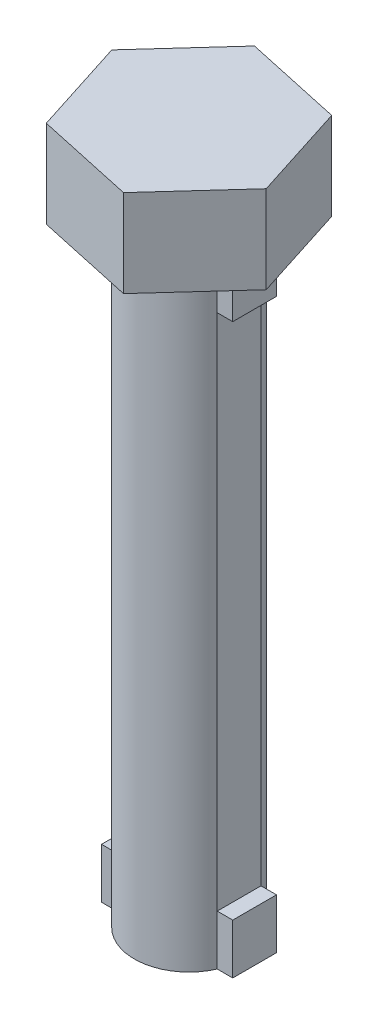
ISO-10303-21;
HEADER;
FILE_DESCRIPTION(('STEP AP214'),'2;1');
FILE_NAME('part.step','',(''),(''),'','','');
FILE_SCHEMA(('AUTOMOTIVE_DESIGN { 1 0 10303 214 1 1 1 1 }'));
ENDSEC;
DATA;
#1=APPLICATION_CONTEXT('core data for automotive mechanical design processes');
#2=APPLICATION_PROTOCOL_DEFINITION('international standard','automotive_design',2000,#1);
#3=PRODUCT_CONTEXT('',#1,'mechanical');
#4=PRODUCT('Part','Part','',(#3));
#5=PRODUCT_RELATED_PRODUCT_CATEGORY('part','',(#4));
#6=PRODUCT_DEFINITION_FORMATION('','',#4);
#7=PRODUCT_DEFINITION_CONTEXT('part definition',#1,'design');
#8=PRODUCT_DEFINITION('design','',#6,#7);
#9=PRODUCT_DEFINITION_SHAPE('','',#8);
#10=(LENGTH_UNIT() NAMED_UNIT(*) SI_UNIT(.MILLI.,.METRE.));
#11=(NAMED_UNIT(*) PLANE_ANGLE_UNIT() SI_UNIT($,.RADIAN.));
#12=(NAMED_UNIT(*) SI_UNIT($,.STERADIAN.) SOLID_ANGLE_UNIT());
#13=UNCERTAINTY_MEASURE_WITH_UNIT(LENGTH_MEASURE(1.E-05),#10,'distance_accuracy_value','');
#14=(GEOMETRIC_REPRESENTATION_CONTEXT(3) GLOBAL_UNCERTAINTY_ASSIGNED_CONTEXT((#13)) GLOBAL_UNIT_ASSIGNED_CONTEXT((#10,
#11,#12)) REPRESENTATION_CONTEXT('',''));
#15=CARTESIAN_POINT('',(0.,0.,0.));
#16=DIRECTION('',(0.,0.,1.));
#17=DIRECTION('',(1.,0.,0.));
#18=AXIS2_PLACEMENT_3D('',#15,#16,#17);
#19=CARTESIAN_POINT('',(-1.14564392373896,14.,0.5));
#20=DIRECTION('',(0.,0.,-1.));
#21=DIRECTION('',(-1.,0.,0.));
#22=AXIS2_PLACEMENT_3D('',#19,#20,#21);
#23=PLANE('',#22);
#24=DIRECTION('',(0.,-1.,0.));
#25=VECTOR('',#24,1.);
#26=CARTESIAN_POINT('',(-1.5,14.,0.5));
#27=LINE('',#26,#25);
#28=CARTESIAN_POINT('',(-1.5,14.,0.5));
#29=VERTEX_POINT('',#28);
#30=CARTESIAN_POINT('',(-1.5,12.9938938876232,0.5));
#31=VERTEX_POINT('',#30);
#32=EDGE_CURVE('E363',#29,#31,#27,.T.);
#33=ORIENTED_EDGE('',*,*,#32,.T.);
#34=DIRECTION('',(1.,0.,0.));
#35=VECTOR('',#34,1.);
#36=CARTESIAN_POINT('',(-1.14564392373896,12.9938938876232,0.5));
#37=LINE('',#36,#35);
#38=CARTESIAN_POINT('',(-1.14564392373896,12.9938938876232,0.5));
#39=VERTEX_POINT('',#38);
#40=EDGE_CURVE('E256',#31,#39,#37,.T.);
#41=ORIENTED_EDGE('',*,*,#40,.T.);
#42=DIRECTION('',(0.,-1.,0.));
#43=VECTOR('',#42,1.);
#44=CARTESIAN_POINT('',(-1.14564392373896,14.,0.5));
#45=LINE('',#44,#43);
#46=CARTESIAN_POINT('',(-1.14564392373896,14.,0.5));
#47=VERTEX_POINT('',#46);
#48=EDGE_CURVE('E244',#47,#39,#45,.T.);
#49=ORIENTED_EDGE('',*,*,#48,.F.);
#50=DIRECTION('',(1.,0.,0.));
#51=VECTOR('',#50,1.);
#52=CARTESIAN_POINT('',(-1.14564392373896,14.,0.5));
#53=LINE('',#52,#51);
#54=EDGE_CURVE('E323',#29,#47,#53,.T.);
#55=ORIENTED_EDGE('',*,*,#54,.F.);
#56=EDGE_LOOP('',(#33,#41,#49,#55));
#57=FACE_BOUND('',#56,.T.);
#58=ADVANCED_FACE('F33',(#57),#23,.F.);
#59=CARTESIAN_POINT('',(1.5,14.,0.5));
#60=DIRECTION('',(0.,0.,-1.));
#61=DIRECTION('',(-1.,0.,0.));
#62=AXIS2_PLACEMENT_3D('',#59,#60,#61);
#63=PLANE('',#62);
#64=DIRECTION('',(0.,-1.,0.));
#65=VECTOR('',#64,1.);
#66=CARTESIAN_POINT('',(1.5,14.,0.5));
#67=LINE('',#66,#65);
#68=CARTESIAN_POINT('',(1.5,1.14700488640253,0.5));
#69=VERTEX_POINT('',#68);
#70=CARTESIAN_POINT('',(1.5,0.,0.5));
#71=VERTEX_POINT('',#70);
#72=EDGE_CURVE('E234',#69,#71,#67,.T.);
#73=ORIENTED_EDGE('',*,*,#72,.F.);
#74=DIRECTION('',(-1.,0.,0.));
#75=VECTOR('',#74,1.);
#76=CARTESIAN_POINT('',(1.5,1.14700488640253,0.5));
#77=LINE('',#76,#75);
#78=CARTESIAN_POINT('',(1.14564392373896,1.14700488640253,0.5));
#79=VERTEX_POINT('',#78);
#80=EDGE_CURVE('E275',#69,#79,#77,.T.);
#81=ORIENTED_EDGE('',*,*,#80,.T.);
#82=DIRECTION('',(0.,-1.,0.));
#83=VECTOR('',#82,1.);
#84=CARTESIAN_POINT('',(1.14564392373896,14.,0.5));
#85=LINE('',#84,#83);
#86=CARTESIAN_POINT('',(1.14564392373896,0.,0.5));
#87=VERTEX_POINT('',#86);
#88=EDGE_CURVE('E239',#79,#87,#85,.T.);
#89=ORIENTED_EDGE('',*,*,#88,.T.);
#90=DIRECTION('',(1.,0.,0.));
#91=VECTOR('',#90,1.);
#92=CARTESIAN_POINT('',(1.5,0.,0.5));
#93=LINE('',#92,#91);
#94=EDGE_CURVE('E352',#87,#71,#93,.T.);
#95=ORIENTED_EDGE('',*,*,#94,.T.);
#96=EDGE_LOOP('',(#73,#81,#89,#95));
#97=FACE_BOUND('',#96,.T.);
#98=ADVANCED_FACE('F390',(#97),#63,.F.);
#99=CARTESIAN_POINT('',(1.5,14.,-0.5));
#100=DIRECTION('',(-1.,0.,0.));
#101=DIRECTION('',(0.,0.,1.));
#102=AXIS2_PLACEMENT_3D('',#99,#100,#101);
#103=PLANE('',#102);
#104=DIRECTION('',(0.,-1.,0.));
#105=VECTOR('',#104,1.);
#106=CARTESIAN_POINT('',(1.5,14.,-0.5));
#107=LINE('',#106,#105);
#108=CARTESIAN_POINT('',(1.5,1.14700488640253,-0.5));
#109=VERTEX_POINT('',#108);
#110=CARTESIAN_POINT('',(1.5,0.,-0.5));
#111=VERTEX_POINT('',#110);
#112=EDGE_CURVE('E226',#109,#111,#107,.T.);
#113=ORIENTED_EDGE('',*,*,#112,.F.);
#114=DIRECTION('',(0.,0.,1.));
#115=VECTOR('',#114,1.);
#116=CARTESIAN_POINT('',(1.5,1.14700488640253,-2.19987668156487));
#117=LINE('',#116,#115);
#118=EDGE_CURVE('E383',#109,#69,#117,.T.);
#119=ORIENTED_EDGE('',*,*,#118,.T.);
#120=ORIENTED_EDGE('',*,*,#72,.T.);
#121=DIRECTION('',(0.,0.,-1.));
#122=VECTOR('',#121,1.);
#123=CARTESIAN_POINT('',(1.5,0.,-0.5));
#124=LINE('',#123,#122);
#125=EDGE_CURVE('E355',#71,#111,#124,.T.);
#126=ORIENTED_EDGE('',*,*,#125,.T.);
#127=EDGE_LOOP('',(#113,#119,#120,#126));
#128=FACE_BOUND('',#127,.T.);
#129=ADVANCED_FACE('F387',(#128),#103,.F.);
#130=CARTESIAN_POINT('',(1.5,14.,-0.5));
#131=DIRECTION('',(0.,0.,1.));
#132=DIRECTION('',(1.,0.,0.));
#133=AXIS2_PLACEMENT_3D('',#130,#131,#132);
#134=PLANE('',#133);
#135=DIRECTION('',(0.,-1.,0.));
#136=VECTOR('',#135,1.);
#137=CARTESIAN_POINT('',(1.14564392373896,14.,-0.5));
#138=LINE('',#137,#136);
#139=CARTESIAN_POINT('',(1.14564392373896,1.14700488640253,-0.5));
#140=VERTEX_POINT('',#139);
#141=CARTESIAN_POINT('',(1.14564392373896,0.,-0.5));
#142=VERTEX_POINT('',#141);
#143=EDGE_CURVE('E215',#140,#142,#138,.T.);
#144=ORIENTED_EDGE('',*,*,#143,.F.);
#145=DIRECTION('',(1.,0.,0.));
#146=VECTOR('',#145,1.);
#147=CARTESIAN_POINT('',(1.5,1.14700488640253,-0.5));
#148=LINE('',#147,#146);
#149=EDGE_CURVE('E273',#140,#109,#148,.T.);
#150=ORIENTED_EDGE('',*,*,#149,.T.);
#151=ORIENTED_EDGE('',*,*,#112,.T.);
#152=DIRECTION('',(-1.,0.,0.));
#153=VECTOR('',#152,1.);
#154=CARTESIAN_POINT('',(1.5,0.,-0.5));
#155=LINE('',#154,#153);
#156=EDGE_CURVE('E357',#111,#142,#155,.T.);
#157=ORIENTED_EDGE('',*,*,#156,.T.);
#158=EDGE_LOOP('',(#144,#150,#151,#157));
#159=FACE_BOUND('',#158,.T.);
#160=ADVANCED_FACE('F399',(#159),#134,.F.);
#161=CARTESIAN_POINT('',(-1.14564392373896,14.,-0.5));
#162=DIRECTION('',(0.,0.,1.));
#163=DIRECTION('',(1.,0.,0.));
#164=AXIS2_PLACEMENT_3D('',#161,#162,#163);
#165=PLANE('',#164);
#166=DIRECTION('',(0.,-1.,0.));
#167=VECTOR('',#166,1.);
#168=CARTESIAN_POINT('',(-1.14564392373896,14.,-0.5));
#169=LINE('',#168,#167);
#170=CARTESIAN_POINT('',(-1.14564392373896,14.,-0.5));
#171=VERTEX_POINT('',#170);
#172=CARTESIAN_POINT('',(-1.14564392373896,12.9938938876232,-0.5));
#173=VERTEX_POINT('',#172);
#174=EDGE_CURVE('E193',#171,#173,#169,.T.);
#175=ORIENTED_EDGE('',*,*,#174,.T.);
#176=DIRECTION('',(-1.,0.,0.));
#177=VECTOR('',#176,1.);
#178=CARTESIAN_POINT('',(-1.14564392373896,12.9938938876232,-0.5));
#179=LINE('',#178,#177);
#180=CARTESIAN_POINT('',(-1.5,12.9938938876232,-0.5));
#181=VERTEX_POINT('',#180);
#182=EDGE_CURVE('E254',#173,#181,#179,.T.);
#183=ORIENTED_EDGE('',*,*,#182,.T.);
#184=DIRECTION('',(0.,-1.,0.));
#185=VECTOR('',#184,1.);
#186=CARTESIAN_POINT('',(-1.5,14.,-0.5));
#187=LINE('',#186,#185);
#188=CARTESIAN_POINT('',(-1.5,14.,-0.5));
#189=VERTEX_POINT('',#188);
#190=EDGE_CURVE('E211',#189,#181,#187,.T.);
#191=ORIENTED_EDGE('',*,*,#190,.F.);
#192=DIRECTION('',(-1.,0.,0.));
#193=VECTOR('',#192,1.);
#194=CARTESIAN_POINT('',(-1.14564392373896,14.,-0.5));
#195=LINE('',#194,#193);
#196=EDGE_CURVE('E342',#171,#189,#195,.T.);
#197=ORIENTED_EDGE('',*,*,#196,.F.);
#198=EDGE_LOOP('',(#175,#183,#191,#197));
#199=FACE_BOUND('',#198,.T.);
#200=ADVANCED_FACE('F373',(#199),#165,.F.);
#201=CARTESIAN_POINT('',(-1.5,14.,-0.5));
#202=DIRECTION('',(1.,0.,0.));
#203=DIRECTION('',(0.,0.,-1.));
#204=AXIS2_PLACEMENT_3D('',#201,#202,#203);
#205=PLANE('',#204);
#206=ORIENTED_EDGE('',*,*,#190,.T.);
#207=DIRECTION('',(0.,0.,1.));
#208=VECTOR('',#207,1.);
#209=CARTESIAN_POINT('',(-1.5,12.9938938876232,-0.5));
#210=LINE('',#209,#208);
#211=EDGE_CURVE('E11',#181,#31,#210,.T.);
#212=ORIENTED_EDGE('',*,*,#211,.T.);
#213=ORIENTED_EDGE('',*,*,#32,.F.);
#214=DIRECTION('',(0.,0.,1.));
#215=VECTOR('',#214,1.);
#216=CARTESIAN_POINT('',(-1.5,14.,-0.5));
#217=LINE('',#216,#215);
#218=EDGE_CURVE('E345',#189,#29,#217,.T.);
#219=ORIENTED_EDGE('',*,*,#218,.F.);
#220=EDGE_LOOP('',(#206,#212,#213,#219));
#221=FACE_BOUND('',#220,.T.);
#222=ADVANCED_FACE('F370',(#221),#205,.F.);
#223=CARTESIAN_POINT('',(-1.14564392373896,1.14700488640253,0.5));
#224=VERTEX_POINT('',#223);
#225=CARTESIAN_POINT('',(-1.14564392373896,0.,0.5));
#226=VERTEX_POINT('',#225);
#227=EDGE_CURVE('E243',#224,#226,#45,.T.);
#228=ORIENTED_EDGE('',*,*,#227,.F.);
#229=DIRECTION('',(-1.,0.,0.));
#230=VECTOR('',#229,1.);
#231=CARTESIAN_POINT('',(-1.14564392373896,1.14700488640253,0.5));
#232=LINE('',#231,#230);
#233=CARTESIAN_POINT('',(-1.5,1.14700488640253,0.5));
#234=VERTEX_POINT('',#233);
#235=EDGE_CURVE('E198',#224,#234,#232,.T.);
#236=ORIENTED_EDGE('',*,*,#235,.T.);
#237=CARTESIAN_POINT('',(-1.5,0.,0.5));
#238=VERTEX_POINT('',#237);
#239=EDGE_CURVE('E250',#234,#238,#27,.T.);
#240=ORIENTED_EDGE('',*,*,#239,.T.);
#241=DIRECTION('',(1.,0.,0.));
#242=VECTOR('',#241,1.);
#243=CARTESIAN_POINT('',(-1.14564392373896,0.,0.5));
#244=LINE('',#243,#242);
#245=EDGE_CURVE('E322',#238,#226,#244,.T.);
#246=ORIENTED_EDGE('',*,*,#245,.T.);
#247=EDGE_LOOP('',(#228,#236,#240,#246));
#248=FACE_BOUND('',#247,.T.);
#249=ADVANCED_FACE('F35',(#248),#23,.F.);
#250=CARTESIAN_POINT('',(0.,14.,0.));
#251=DIRECTION('',(0.,-1.,0.));
#252=DIRECTION('',(0.,0.,-1.));
#253=AXIS2_PLACEMENT_3D('',#250,#251,#252);
#254=CYLINDRICAL_SURFACE('',#253,1.25);
#255=CARTESIAN_POINT('',(0.,0.,0.));
#256=DIRECTION('',(0.,1.,0.));
#257=DIRECTION('',(0.,0.,1.));
#258=AXIS2_PLACEMENT_3D('',#255,#256,#257);
#259=CIRCLE('',#258,1.25);
#260=EDGE_CURVE('E349',#226,#87,#259,.T.);
#261=ORIENTED_EDGE('',*,*,#260,.T.);
#262=ORIENTED_EDGE('',*,*,#88,.F.);
#263=DIRECTION('',(0.,1.,0.));
#264=VECTOR('',#263,1.);
#265=CARTESIAN_POINT('',(1.14564392373896,14.,0.5));
#266=LINE('',#265,#264);
#267=CARTESIAN_POINT('',(1.14564392373896,12.9938938876232,0.5));
#268=VERTEX_POINT('',#267);
#269=EDGE_CURVE('E270',#79,#268,#266,.T.);
#270=ORIENTED_EDGE('',*,*,#269,.T.);
#271=CARTESIAN_POINT('',(1.14564392373896,14.,0.5));
#272=VERTEX_POINT('',#271);
#273=EDGE_CURVE('E240',#272,#268,#85,.T.);
#274=ORIENTED_EDGE('',*,*,#273,.F.);
#275=CARTESIAN_POINT('',(0.,14.,0.));
#276=DIRECTION('',(0.,1.,0.));
#277=DIRECTION('',(0.,0.,1.));
#278=AXIS2_PLACEMENT_3D('',#275,#276,#277);
#279=CIRCLE('',#278,1.25);
#280=EDGE_CURVE('E326',#47,#272,#279,.T.);
#281=ORIENTED_EDGE('',*,*,#280,.F.);
#282=ORIENTED_EDGE('',*,*,#48,.T.);
#283=DIRECTION('',(0.,-1.,0.));
#284=VECTOR('',#283,1.);
#285=CARTESIAN_POINT('',(-1.14564392373896,14.,0.5));
#286=LINE('',#285,#284);
#287=EDGE_CURVE('E262',#39,#224,#286,.T.);
#288=ORIENTED_EDGE('',*,*,#287,.T.);
#289=ORIENTED_EDGE('',*,*,#227,.T.);
#290=EDGE_LOOP('',(#261,#262,#270,#274,#281,#282,#288,#289));
#291=FACE_BOUND('',#290,.T.);
#292=ADVANCED_FACE('F415',(#291),#254,.T.);
#293=ORIENTED_EDGE('',*,*,#273,.T.);
#294=DIRECTION('',(1.,0.,0.));
#295=VECTOR('',#294,1.);
#296=CARTESIAN_POINT('',(1.5,12.9938938876232,0.5));
#297=LINE('',#296,#295);
#298=CARTESIAN_POINT('',(1.5,12.9938938876232,0.5));
#299=VERTEX_POINT('',#298);
#300=EDGE_CURVE('E267',#268,#299,#297,.T.);
#301=ORIENTED_EDGE('',*,*,#300,.T.);
#302=CARTESIAN_POINT('',(1.5,14.,0.5));
#303=VERTEX_POINT('',#302);
#304=EDGE_CURVE('E236',#303,#299,#67,.T.);
#305=ORIENTED_EDGE('',*,*,#304,.F.);
#306=DIRECTION('',(1.,0.,0.));
#307=VECTOR('',#306,1.);
#308=CARTESIAN_POINT('',(1.5,14.,0.5));
#309=LINE('',#308,#307);
#310=EDGE_CURVE('E330',#272,#303,#309,.T.);
#311=ORIENTED_EDGE('',*,*,#310,.F.);
#312=EDGE_LOOP('',(#293,#301,#305,#311));
#313=FACE_BOUND('',#312,.T.);
#314=ADVANCED_FACE('F412',(#313),#63,.F.);
#315=ORIENTED_EDGE('',*,*,#304,.T.);
#316=DIRECTION('',(0.,0.,1.));
#317=VECTOR('',#316,1.);
#318=CARTESIAN_POINT('',(1.5,12.9938938876232,-2.19987668156487));
#319=LINE('',#318,#317);
#320=CARTESIAN_POINT('',(1.5,12.9938938876232,-0.5));
#321=VERTEX_POINT('',#320);
#322=EDGE_CURVE('E382',#321,#299,#319,.T.);
#323=ORIENTED_EDGE('',*,*,#322,.F.);
#324=CARTESIAN_POINT('',(1.5,14.,-0.5));
#325=VERTEX_POINT('',#324);
#326=EDGE_CURVE('E228',#325,#321,#107,.T.);
#327=ORIENTED_EDGE('',*,*,#326,.F.);
#328=DIRECTION('',(0.,0.,-1.));
#329=VECTOR('',#328,1.);
#330=CARTESIAN_POINT('',(1.5,14.,-0.5));
#331=LINE('',#330,#329);
#332=EDGE_CURVE('E333',#303,#325,#331,.T.);
#333=ORIENTED_EDGE('',*,*,#332,.F.);
#334=EDGE_LOOP('',(#315,#323,#327,#333));
#335=FACE_BOUND('',#334,.T.);
#336=ADVANCED_FACE('F410',(#335),#103,.F.);
#337=ORIENTED_EDGE('',*,*,#326,.T.);
#338=DIRECTION('',(-1.,0.,0.));
#339=VECTOR('',#338,1.);
#340=CARTESIAN_POINT('',(1.5,12.9938938876232,-0.5));
#341=LINE('',#340,#339);
#342=CARTESIAN_POINT('',(1.14564392373896,12.9938938876232,-0.5));
#343=VERTEX_POINT('',#342);
#344=EDGE_CURVE('E264',#321,#343,#341,.T.);
#345=ORIENTED_EDGE('',*,*,#344,.T.);
#346=CARTESIAN_POINT('',(1.14564392373896,14.,-0.5));
#347=VERTEX_POINT('',#346);
#348=EDGE_CURVE('E220',#347,#343,#138,.T.);
#349=ORIENTED_EDGE('',*,*,#348,.F.);
#350=DIRECTION('',(-1.,0.,0.));
#351=VECTOR('',#350,1.);
#352=CARTESIAN_POINT('',(1.5,14.,-0.5));
#353=LINE('',#352,#351);
#354=EDGE_CURVE('E336',#325,#347,#353,.T.);
#355=ORIENTED_EDGE('',*,*,#354,.F.);
#356=EDGE_LOOP('',(#337,#345,#349,#355));
#357=FACE_BOUND('',#356,.T.);
#358=ADVANCED_FACE('F406',(#357),#134,.F.);
#359=CARTESIAN_POINT('',(0.,14.,0.));
#360=DIRECTION('',(0.,-1.,0.));
#361=DIRECTION('',(0.,0.,-1.));
#362=AXIS2_PLACEMENT_3D('',#359,#360,#361);
#363=CYLINDRICAL_SURFACE('',#362,1.25);
#364=CARTESIAN_POINT('',(0.,0.,0.));
#365=DIRECTION('',(0.,1.,0.));
#366=DIRECTION('',(0.,0.,1.));
#367=AXIS2_PLACEMENT_3D('',#364,#365,#366);
#368=CIRCLE('',#367,1.25);
#369=CARTESIAN_POINT('',(-1.14564392373896,0.,-0.5));
#370=VERTEX_POINT('',#369);
#371=EDGE_CURVE('E209',#142,#370,#368,.T.);
#372=ORIENTED_EDGE('',*,*,#371,.T.);
#373=CARTESIAN_POINT('',(-1.14564392373896,1.14700488640253,-0.5));
#374=VERTEX_POINT('',#373);
#375=EDGE_CURVE('E194',#374,#370,#169,.T.);
#376=ORIENTED_EDGE('',*,*,#375,.F.);
#377=EDGE_CURVE('E184',#173,#374,#169,.T.);
#378=ORIENTED_EDGE('',*,*,#377,.F.);
#379=ORIENTED_EDGE('',*,*,#174,.F.);
#380=CARTESIAN_POINT('',(0.,14.,0.));
#381=DIRECTION('',(0.,1.,0.));
#382=DIRECTION('',(0.,0.,1.));
#383=AXIS2_PLACEMENT_3D('',#380,#381,#382);
#384=CIRCLE('',#383,1.25);
#385=EDGE_CURVE('E339',#347,#171,#384,.T.);
#386=ORIENTED_EDGE('',*,*,#385,.F.);
#387=ORIENTED_EDGE('',*,*,#348,.T.);
#388=EDGE_CURVE('E219',#343,#140,#138,.T.);
#389=ORIENTED_EDGE('',*,*,#388,.T.);
#390=ORIENTED_EDGE('',*,*,#143,.T.);
#391=EDGE_LOOP('',(#372,#376,#378,#379,#386,#387,#389,#390));
#392=FACE_BOUND('',#391,.T.);
#393=ADVANCED_FACE('F207',(#392),#363,.T.);
#394=CARTESIAN_POINT('',(-1.5,1.14700488640253,-0.5));
#395=VERTEX_POINT('',#394);
#396=CARTESIAN_POINT('',(-1.5,0.,-0.5));
#397=VERTEX_POINT('',#396);
#398=EDGE_CURVE('E205',#395,#397,#187,.T.);
#399=ORIENTED_EDGE('',*,*,#398,.F.);
#400=DIRECTION('',(1.,0.,0.));
#401=VECTOR('',#400,1.);
#402=CARTESIAN_POINT('',(-1.14564392373896,1.14700488640253,-0.5));
#403=LINE('',#402,#401);
#404=EDGE_CURVE('E56',#395,#374,#403,.T.);
#405=ORIENTED_EDGE('',*,*,#404,.T.);
#406=ORIENTED_EDGE('',*,*,#375,.T.);
#407=DIRECTION('',(-1.,0.,0.));
#408=VECTOR('',#407,1.);
#409=CARTESIAN_POINT('',(-1.14564392373896,0.,-0.5));
#410=LINE('',#409,#408);
#411=EDGE_CURVE('E360',#370,#397,#410,.T.);
#412=ORIENTED_EDGE('',*,*,#411,.T.);
#413=EDGE_LOOP('',(#399,#405,#406,#412));
#414=FACE_BOUND('',#413,.T.);
#415=ADVANCED_FACE('F202',(#414),#165,.F.);
#416=ORIENTED_EDGE('',*,*,#239,.F.);
#417=DIRECTION('',(0.,0.,-1.));
#418=VECTOR('',#417,1.);
#419=CARTESIAN_POINT('',(-1.5,1.14700488640253,-0.5));
#420=LINE('',#419,#418);
#421=EDGE_CURVE('E41',#234,#395,#420,.T.);
#422=ORIENTED_EDGE('',*,*,#421,.T.);
#423=ORIENTED_EDGE('',*,*,#398,.T.);
#424=DIRECTION('',(0.,0.,1.));
#425=VECTOR('',#424,1.);
#426=CARTESIAN_POINT('',(-1.5,0.,-0.5));
#427=LINE('',#426,#425);
#428=EDGE_CURVE('E327',#397,#238,#427,.T.);
#429=ORIENTED_EDGE('',*,*,#428,.T.);
#430=EDGE_LOOP('',(#416,#422,#423,#429));
#431=FACE_BOUND('',#430,.T.);
#432=ADVANCED_FACE('F248',(#431),#205,.F.);
#433=CARTESIAN_POINT('',(0.,0.,0.));
#434=DIRECTION('',(0.,1.,0.));
#435=DIRECTION('',(0.,0.,1.));
#436=AXIS2_PLACEMENT_3D('',#433,#434,#435);
#437=PLANE('',#436);
#438=ORIENTED_EDGE('',*,*,#245,.F.);
#439=ORIENTED_EDGE('',*,*,#428,.F.);
#440=ORIENTED_EDGE('',*,*,#411,.F.);
#441=ORIENTED_EDGE('',*,*,#371,.F.);
#442=ORIENTED_EDGE('',*,*,#156,.F.);
#443=ORIENTED_EDGE('',*,*,#125,.F.);
#444=ORIENTED_EDGE('',*,*,#94,.F.);
#445=ORIENTED_EDGE('',*,*,#260,.F.);
#446=EDGE_LOOP('',(#438,#439,#440,#441,#442,#443,#444,#445));
#447=FACE_BOUND('',#446,.T.);
#448=ADVANCED_FACE('F398',(#447),#437,.F.);
#449=CARTESIAN_POINT('',(0.,14.,0.));
#450=DIRECTION('',(0.,1.,0.));
#451=DIRECTION('',(0.,0.,1.));
#452=AXIS2_PLACEMENT_3D('',#449,#450,#451);
#453=PLANE('',#452);
#454=DIRECTION('',(0.304305331628589,0.,0.952574545714095));
#455=VECTOR('',#454,1.);
#456=CARTESIAN_POINT('',(-2.2565306216914,14.,-0.491327677525259));
#457=LINE('',#456,#455);
#458=CARTESIAN_POINT('',(-2.2565306216914,14.,-0.491327677525259));
#459=VERTEX_POINT('',#458);
#460=CARTESIAN_POINT('',(-1.55376756116498,14.,1.70854900403961));
#461=VERTEX_POINT('',#460);
#462=EDGE_CURVE('E278',#459,#461,#457,.T.);
#463=ORIENTED_EDGE('',*,*,#462,.F.);
#464=DIRECTION('',(-0.672801089772533,0.,0.739823420554453));
#465=VECTOR('',#464,1.);
#466=CARTESIAN_POINT('',(-0.702763060526416,14.,-2.19987668156487));
#467=LINE('',#466,#465);
#468=CARTESIAN_POINT('',(-0.702763060526416,14.,-2.19987668156487));
#469=VERTEX_POINT('',#468);
#470=EDGE_CURVE('E283',#469,#459,#467,.T.);
#471=ORIENTED_EDGE('',*,*,#470,.F.);
#472=DIRECTION('',(-0.977106421401122,0.,-0.212751125159642));
#473=VECTOR('',#472,1.);
#474=CARTESIAN_POINT('',(1.55376756116498,14.,-1.70854900403961));
#475=LINE('',#474,#473);
#476=CARTESIAN_POINT('',(1.55376756116498,14.,-1.70854900403961));
#477=VERTEX_POINT('',#476);
#478=EDGE_CURVE('E302',#477,#469,#475,.T.);
#479=ORIENTED_EDGE('',*,*,#478,.F.);
#480=DIRECTION('',(-0.304305331628589,0.,-0.952574545714095));
#481=VECTOR('',#480,1.);
#482=CARTESIAN_POINT('',(2.2565306216914,14.,0.491327677525259));
#483=LINE('',#482,#481);
#484=CARTESIAN_POINT('',(2.2565306216914,14.,0.491327677525259));
#485=VERTEX_POINT('',#484);
#486=EDGE_CURVE('E300',#485,#477,#483,.T.);
#487=ORIENTED_EDGE('',*,*,#486,.F.);
#488=DIRECTION('',(0.672801089772533,0.,-0.739823420554454));
#489=VECTOR('',#488,1.);
#490=CARTESIAN_POINT('',(0.702763060526417,14.,2.19987668156487));
#491=LINE('',#490,#489);
#492=CARTESIAN_POINT('',(0.702763060526417,14.,2.19987668156487));
#493=VERTEX_POINT('',#492);
#494=EDGE_CURVE('E298',#493,#485,#491,.T.);
#495=ORIENTED_EDGE('',*,*,#494,.F.);
#496=DIRECTION('',(0.977106421401122,0.,0.212751125159642));
#497=VECTOR('',#496,1.);
#498=CARTESIAN_POINT('',(-1.55376756116498,14.,1.70854900403961));
#499=LINE('',#498,#497);
#500=EDGE_CURVE('E296',#461,#493,#499,.T.);
#501=ORIENTED_EDGE('',*,*,#500,.F.);
#502=EDGE_LOOP('',(#463,#471,#479,#487,#495,#501));
#503=FACE_BOUND('',#502,.T.);
#504=ORIENTED_EDGE('',*,*,#218,.T.);
#505=ORIENTED_EDGE('',*,*,#54,.T.);
#506=ORIENTED_EDGE('',*,*,#280,.T.);
#507=ORIENTED_EDGE('',*,*,#310,.T.);
#508=ORIENTED_EDGE('',*,*,#332,.T.);
#509=ORIENTED_EDGE('',*,*,#354,.T.);
#510=ORIENTED_EDGE('',*,*,#385,.T.);
#511=ORIENTED_EDGE('',*,*,#196,.T.);
#512=EDGE_LOOP('',(#504,#505,#506,#507,#508,#509,#510,#511));
#513=FACE_BOUND('',#512,.T.);
#514=ADVANCED_FACE('F372',(#503,#513),#453,.F.);
#515=CARTESIAN_POINT('',(-2.2565306216914,16.,-0.491327677525259));
#516=DIRECTION('',(0.952574545714095,0.,-0.304305331628589));
#517=DIRECTION('',(-0.304305331628589,0.,-0.952574545714095));
#518=AXIS2_PLACEMENT_3D('',#515,#516,#517);
#519=PLANE('',#518);
#520=ORIENTED_EDGE('',*,*,#462,.T.);
#521=DIRECTION('',(0.,-1.,0.));
#522=VECTOR('',#521,1.);
#523=CARTESIAN_POINT('',(-1.55376756116498,16.,1.70854900403961));
#524=LINE('',#523,#522);
#525=CARTESIAN_POINT('',(-1.55376756116498,16.,1.70854900403961));
#526=VERTEX_POINT('',#525);
#527=EDGE_CURVE('E319',#526,#461,#524,.T.);
#528=ORIENTED_EDGE('',*,*,#527,.F.);
#529=DIRECTION('',(0.304305331628589,0.,0.952574545714095));
#530=VECTOR('',#529,1.);
#531=CARTESIAN_POINT('',(-2.2565306216914,16.,-0.491327677525259));
#532=LINE('',#531,#530);
#533=CARTESIAN_POINT('',(-2.2565306216914,16.,-0.491327677525259));
#534=VERTEX_POINT('',#533);
#535=EDGE_CURVE('E279',#534,#526,#532,.T.);
#536=ORIENTED_EDGE('',*,*,#535,.F.);
#537=DIRECTION('',(0.,-1.,0.));
#538=VECTOR('',#537,1.);
#539=CARTESIAN_POINT('',(-2.2565306216914,16.,-0.491327677525259));
#540=LINE('',#539,#538);
#541=EDGE_CURVE('E293',#534,#459,#540,.T.);
#542=ORIENTED_EDGE('',*,*,#541,.T.);
#543=EDGE_LOOP('',(#520,#528,#536,#542));
#544=FACE_BOUND('',#543,.T.);
#545=ADVANCED_FACE('F570',(#544),#519,.F.);
#546=CARTESIAN_POINT('',(-1.55376756116498,16.,1.70854900403961));
#547=DIRECTION('',(0.212751125159642,0.,-0.977106421401122));
#548=DIRECTION('',(-0.977106421401122,0.,-0.212751125159642));
#549=AXIS2_PLACEMENT_3D('',#546,#547,#548);
#550=PLANE('',#549);
#551=ORIENTED_EDGE('',*,*,#500,.T.);
#552=DIRECTION('',(0.,-1.,0.));
#553=VECTOR('',#552,1.);
#554=CARTESIAN_POINT('',(0.702763060526417,16.,2.19987668156487));
#555=LINE('',#554,#553);
#556=CARTESIAN_POINT('',(0.702763060526417,16.,2.19987668156487));
#557=VERTEX_POINT('',#556);
#558=EDGE_CURVE('E316',#557,#493,#555,.T.);
#559=ORIENTED_EDGE('',*,*,#558,.F.);
#560=DIRECTION('',(0.977106421401122,0.,0.212751125159642));
#561=VECTOR('',#560,1.);
#562=CARTESIAN_POINT('',(-1.55376756116498,16.,1.70854900403961));
#563=LINE('',#562,#561);
#564=EDGE_CURVE('E282',#526,#557,#563,.T.);
#565=ORIENTED_EDGE('',*,*,#564,.F.);
#566=ORIENTED_EDGE('',*,*,#527,.T.);
#567=EDGE_LOOP('',(#551,#559,#565,#566));
#568=FACE_BOUND('',#567,.T.);
#569=ADVANCED_FACE('F562',(#568),#550,.F.);
#570=CARTESIAN_POINT('',(0.702763060526417,16.,2.19987668156487));
#571=DIRECTION('',(-0.739823420554454,0.,-0.672801089772533));
#572=DIRECTION('',(-0.672801089772533,0.,0.739823420554454));
#573=AXIS2_PLACEMENT_3D('',#570,#571,#572);
#574=PLANE('',#573);
#575=ORIENTED_EDGE('',*,*,#494,.T.);
#576=DIRECTION('',(0.,-1.,0.));
#577=VECTOR('',#576,1.);
#578=CARTESIAN_POINT('',(2.2565306216914,16.,0.491327677525259));
#579=LINE('',#578,#577);
#580=CARTESIAN_POINT('',(2.2565306216914,16.,0.491327677525259));
#581=VERTEX_POINT('',#580);
#582=EDGE_CURVE('E313',#581,#485,#579,.T.);
#583=ORIENTED_EDGE('',*,*,#582,.F.);
#584=DIRECTION('',(0.672801089772533,0.,-0.739823420554454));
#585=VECTOR('',#584,1.);
#586=CARTESIAN_POINT('',(0.702763060526417,16.,2.19987668156487));
#587=LINE('',#586,#585);
#588=EDGE_CURVE('E285',#557,#581,#587,.T.);
#589=ORIENTED_EDGE('',*,*,#588,.F.);
#590=ORIENTED_EDGE('',*,*,#558,.T.);
#591=EDGE_LOOP('',(#575,#583,#589,#590));
#592=FACE_BOUND('',#591,.T.);
#593=ADVANCED_FACE('F554',(#592),#574,.F.);
#594=CARTESIAN_POINT('',(2.2565306216914,16.,0.491327677525259));
#595=DIRECTION('',(-0.952574545714095,0.,0.304305331628589));
#596=DIRECTION('',(0.304305331628589,0.,0.952574545714095));
#597=AXIS2_PLACEMENT_3D('',#594,#595,#596);
#598=PLANE('',#597);
#599=ORIENTED_EDGE('',*,*,#486,.T.);
#600=DIRECTION('',(0.,-1.,0.));
#601=VECTOR('',#600,1.);
#602=CARTESIAN_POINT('',(1.55376756116498,16.,-1.70854900403961));
#603=LINE('',#602,#601);
#604=CARTESIAN_POINT('',(1.55376756116498,16.,-1.70854900403961));
#605=VERTEX_POINT('',#604);
#606=EDGE_CURVE('E310',#605,#477,#603,.T.);
#607=ORIENTED_EDGE('',*,*,#606,.F.);
#608=DIRECTION('',(-0.304305331628589,0.,-0.952574545714095));
#609=VECTOR('',#608,1.);
#610=CARTESIAN_POINT('',(2.2565306216914,16.,0.491327677525259));
#611=LINE('',#610,#609);
#612=EDGE_CURVE('E287',#581,#605,#611,.T.);
#613=ORIENTED_EDGE('',*,*,#612,.F.);
#614=ORIENTED_EDGE('',*,*,#582,.T.);
#615=EDGE_LOOP('',(#599,#607,#613,#614));
#616=FACE_BOUND('',#615,.T.);
#617=ADVANCED_FACE('F546',(#616),#598,.F.);
#618=CARTESIAN_POINT('',(1.55376756116498,16.,-1.70854900403961));
#619=DIRECTION('',(-0.212751125159642,0.,0.977106421401122));
#620=DIRECTION('',(0.977106421401122,0.,0.212751125159642));
#621=AXIS2_PLACEMENT_3D('',#618,#619,#620);
#622=PLANE('',#621);
#623=ORIENTED_EDGE('',*,*,#478,.T.);
#624=DIRECTION('',(0.,-1.,0.));
#625=VECTOR('',#624,1.);
#626=CARTESIAN_POINT('',(-0.702763060526416,16.,-2.19987668156487));
#627=LINE('',#626,#625);
#628=CARTESIAN_POINT('',(-0.702763060526416,16.,-2.19987668156487));
#629=VERTEX_POINT('',#628);
#630=EDGE_CURVE('E307',#629,#469,#627,.T.);
#631=ORIENTED_EDGE('',*,*,#630,.F.);
#632=DIRECTION('',(-0.977106421401122,0.,-0.212751125159642));
#633=VECTOR('',#632,1.);
#634=CARTESIAN_POINT('',(1.55376756116498,16.,-1.70854900403961));
#635=LINE('',#634,#633);
#636=EDGE_CURVE('E289',#605,#629,#635,.T.);
#637=ORIENTED_EDGE('',*,*,#636,.F.);
#638=ORIENTED_EDGE('',*,*,#606,.T.);
#639=EDGE_LOOP('',(#623,#631,#637,#638));
#640=FACE_BOUND('',#639,.T.);
#641=ADVANCED_FACE('F538',(#640),#622,.F.);
#642=CARTESIAN_POINT('',(-0.702763060526416,16.,-2.19987668156487));
#643=DIRECTION('',(0.739823420554454,0.,0.672801089772533));
#644=DIRECTION('',(0.672801089772533,0.,-0.739823420554454));
#645=AXIS2_PLACEMENT_3D('',#642,#643,#644);
#646=PLANE('',#645);
#647=ORIENTED_EDGE('',*,*,#470,.T.);
#648=ORIENTED_EDGE('',*,*,#541,.F.);
#649=DIRECTION('',(-0.672801089772533,0.,0.739823420554453));
#650=VECTOR('',#649,1.);
#651=CARTESIAN_POINT('',(-0.702763060526416,16.,-2.19987668156487));
#652=LINE('',#651,#650);
#653=EDGE_CURVE('E291',#629,#534,#652,.T.);
#654=ORIENTED_EDGE('',*,*,#653,.F.);
#655=ORIENTED_EDGE('',*,*,#630,.T.);
#656=EDGE_LOOP('',(#647,#648,#654,#655));
#657=FACE_BOUND('',#656,.T.);
#658=ADVANCED_FACE('F531',(#657),#646,.F.);
#659=CARTESIAN_POINT('',(0.,16.,0.));
#660=DIRECTION('',(0.,1.,0.));
#661=DIRECTION('',(0.,0.,1.));
#662=AXIS2_PLACEMENT_3D('',#659,#660,#661);
#663=PLANE('',#662);
#664=ORIENTED_EDGE('',*,*,#535,.T.);
#665=ORIENTED_EDGE('',*,*,#564,.T.);
#666=ORIENTED_EDGE('',*,*,#588,.T.);
#667=ORIENTED_EDGE('',*,*,#612,.T.);
#668=ORIENTED_EDGE('',*,*,#636,.T.);
#669=ORIENTED_EDGE('',*,*,#653,.T.);
#670=EDGE_LOOP('',(#664,#665,#666,#667,#668,#669));
#671=FACE_BOUND('',#670,.T.);
#672=ADVANCED_FACE('F491',(#671),#663,.T.);
#673=CARTESIAN_POINT('',(-1.14564392373896,1.14700488640253,-2.19987668156487));
#674=DIRECTION('',(1.,0.,0.));
#675=DIRECTION('',(0.,0.,-1.));
#676=AXIS2_PLACEMENT_3D('',#673,#674,#675);
#677=PLANE('',#676);
#678=DIRECTION('',(0.,0.,1.));
#679=VECTOR('',#678,1.);
#680=CARTESIAN_POINT('',(-1.14564392373896,12.9938938876232,-2.19987668156487));
#681=LINE('',#680,#679);
#682=EDGE_CURVE('E189',#173,#39,#681,.T.);
#683=ORIENTED_EDGE('',*,*,#682,.F.);
#684=ORIENTED_EDGE('',*,*,#377,.T.);
#685=DIRECTION('',(0.,0.,1.));
#686=VECTOR('',#685,1.);
#687=CARTESIAN_POINT('',(-1.14564392373896,1.14700488640253,-2.19987668156487));
#688=LINE('',#687,#686);
#689=EDGE_CURVE('E186',#374,#224,#688,.T.);
#690=ORIENTED_EDGE('',*,*,#689,.T.);
#691=ORIENTED_EDGE('',*,*,#287,.F.);
#692=EDGE_LOOP('',(#683,#684,#690,#691));
#693=FACE_BOUND('',#692,.T.);
#694=ADVANCED_FACE('F185',(#693),#677,.F.);
#695=CARTESIAN_POINT('',(-1.5,12.9938938876232,-2.19987668156487));
#696=DIRECTION('',(0.,1.,0.));
#697=DIRECTION('',(0.,0.,1.));
#698=AXIS2_PLACEMENT_3D('',#695,#696,#697);
#699=PLANE('',#698);
#700=ORIENTED_EDGE('',*,*,#211,.F.);
#701=ORIENTED_EDGE('',*,*,#182,.F.);
#702=ORIENTED_EDGE('',*,*,#682,.T.);
#703=ORIENTED_EDGE('',*,*,#40,.F.);
#704=EDGE_LOOP('',(#700,#701,#702,#703));
#705=FACE_BOUND('',#704,.T.);
#706=ADVANCED_FACE('F375',(#705),#699,.F.);
#707=CARTESIAN_POINT('',(-1.5,1.14700488640253,-2.19987668156487));
#708=DIRECTION('',(0.,-1.,0.));
#709=DIRECTION('',(0.,0.,-1.));
#710=AXIS2_PLACEMENT_3D('',#707,#708,#709);
#711=PLANE('',#710);
#712=ORIENTED_EDGE('',*,*,#689,.F.);
#713=ORIENTED_EDGE('',*,*,#404,.F.);
#714=ORIENTED_EDGE('',*,*,#421,.F.);
#715=ORIENTED_EDGE('',*,*,#235,.F.);
#716=EDGE_LOOP('',(#712,#713,#714,#715));
#717=FACE_BOUND('',#716,.T.);
#718=ADVANCED_FACE('F196',(#717),#711,.F.);
#719=CARTESIAN_POINT('',(1.5,1.14700488640253,-2.19987668156487));
#720=DIRECTION('',(0.,-1.,0.));
#721=DIRECTION('',(0.,0.,-1.));
#722=AXIS2_PLACEMENT_3D('',#719,#720,#721);
#723=PLANE('',#722);
#724=ORIENTED_EDGE('',*,*,#118,.F.);
#725=ORIENTED_EDGE('',*,*,#149,.F.);
#726=DIRECTION('',(0.,0.,1.));
#727=VECTOR('',#726,1.);
#728=CARTESIAN_POINT('',(1.14564392373896,1.14700488640253,-2.19987668156487));
#729=LINE('',#728,#727);
#730=EDGE_CURVE('E48',#140,#79,#729,.T.);
#731=ORIENTED_EDGE('',*,*,#730,.T.);
#732=ORIENTED_EDGE('',*,*,#80,.F.);
#733=EDGE_LOOP('',(#724,#725,#731,#732));
#734=FACE_BOUND('',#733,.T.);
#735=ADVANCED_FACE('F416',(#734),#723,.F.);
#736=CARTESIAN_POINT('',(1.14564392373896,12.9938938876232,-2.19987668156487));
#737=DIRECTION('',(-1.,0.,0.));
#738=DIRECTION('',(0.,0.,1.));
#739=AXIS2_PLACEMENT_3D('',#736,#737,#738);
#740=PLANE('',#739);
#741=ORIENTED_EDGE('',*,*,#730,.F.);
#742=ORIENTED_EDGE('',*,*,#388,.F.);
#743=DIRECTION('',(0.,0.,1.));
#744=VECTOR('',#743,1.);
#745=CARTESIAN_POINT('',(1.14564392373896,12.9938938876232,-2.19987668156487));
#746=LINE('',#745,#744);
#747=EDGE_CURVE('E379',#343,#268,#746,.T.);
#748=ORIENTED_EDGE('',*,*,#747,.T.);
#749=ORIENTED_EDGE('',*,*,#269,.F.);
#750=EDGE_LOOP('',(#741,#742,#748,#749));
#751=FACE_BOUND('',#750,.T.);
#752=ADVANCED_FACE('F401',(#751),#740,.F.);
#753=CARTESIAN_POINT('',(1.5,12.9938938876232,-2.19987668156487));
#754=DIRECTION('',(0.,1.,0.));
#755=DIRECTION('',(0.,0.,1.));
#756=AXIS2_PLACEMENT_3D('',#753,#754,#755);
#757=PLANE('',#756);
#758=ORIENTED_EDGE('',*,*,#747,.F.);
#759=ORIENTED_EDGE('',*,*,#344,.F.);
#760=ORIENTED_EDGE('',*,*,#322,.T.);
#761=ORIENTED_EDGE('',*,*,#300,.F.);
#762=EDGE_LOOP('',(#758,#759,#760,#761));
#763=FACE_BOUND('',#762,.T.);
#764=ADVANCED_FACE('F403',(#763),#757,.F.);
#765=CLOSED_SHELL('',(#58,#98,#129,#160,#200,#222,#249,#292,#314,#336,#358,#393,#415,#432,#448,
#514,#545,#569,#593,#617,#641,#658,#672,#694,#706,#718,#735,#752,#764));
#766=MANIFOLD_SOLID_BREP('B2',#765);
#767=ADVANCED_BREP_SHAPE_REPRESENTATION('',(#18,#766),#14);
#768=SHAPE_DEFINITION_REPRESENTATION(#9,#767);
ENDSEC;
END-ISO-10303-21;
